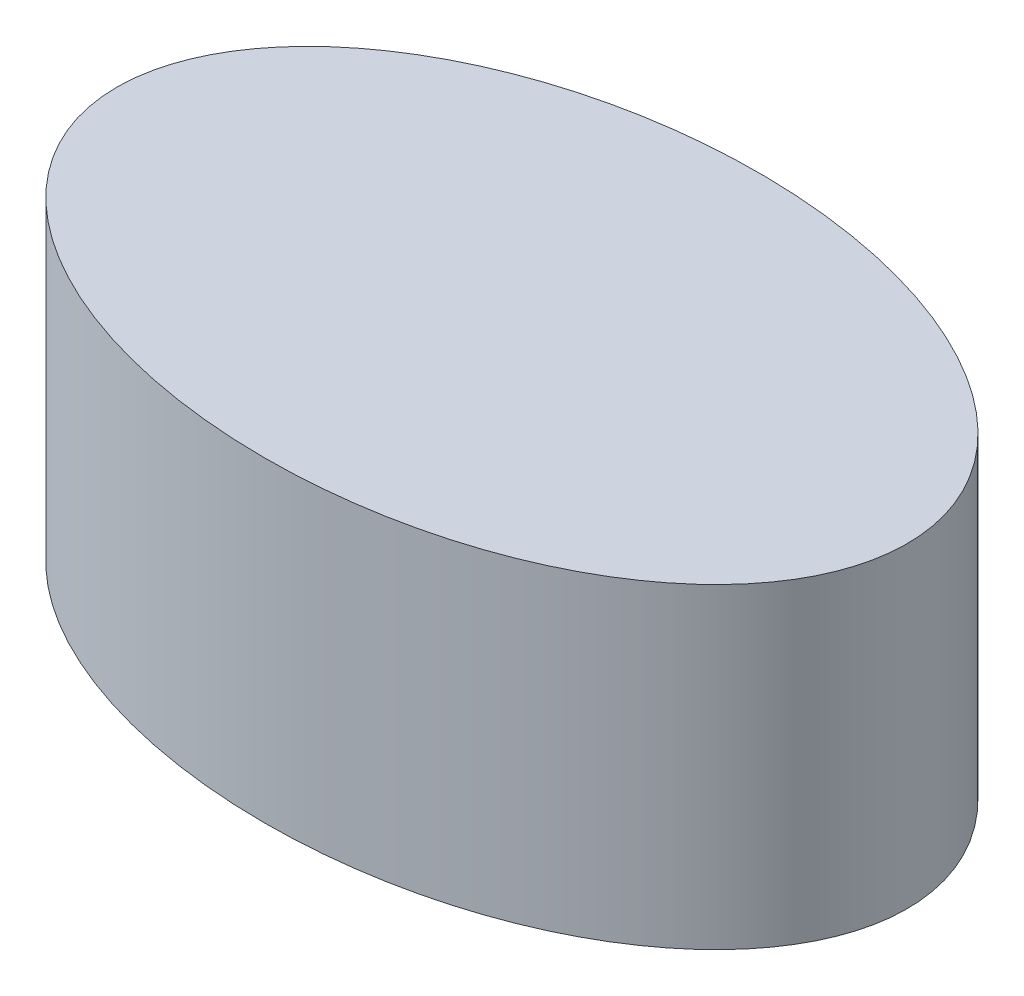
ISO-10303-21;
HEADER;
FILE_DESCRIPTION(('STEP AP214'),'2;1');
FILE_NAME('part.step','',(''),(''),'','','');
FILE_SCHEMA(('AUTOMOTIVE_DESIGN { 1 0 10303 214 1 1 1 1 }'));
ENDSEC;
DATA;
#1=APPLICATION_CONTEXT('core data for automotive mechanical design processes');
#2=APPLICATION_PROTOCOL_DEFINITION('international standard','automotive_design',2000,#1);
#3=PRODUCT_CONTEXT('',#1,'mechanical');
#4=PRODUCT('Part','Part','',(#3));
#5=PRODUCT_RELATED_PRODUCT_CATEGORY('part','',(#4));
#6=PRODUCT_DEFINITION_FORMATION('','',#4);
#7=PRODUCT_DEFINITION_CONTEXT('part definition',#1,'design');
#8=PRODUCT_DEFINITION('design','',#6,#7);
#9=PRODUCT_DEFINITION_SHAPE('','',#8);
#10=(LENGTH_UNIT() NAMED_UNIT(*) SI_UNIT(.MILLI.,.METRE.));
#11=(NAMED_UNIT(*) PLANE_ANGLE_UNIT() SI_UNIT($,.RADIAN.));
#12=(NAMED_UNIT(*) SI_UNIT($,.STERADIAN.) SOLID_ANGLE_UNIT());
#13=UNCERTAINTY_MEASURE_WITH_UNIT(LENGTH_MEASURE(1.E-05),#10,'distance_accuracy_value','');
#14=(GEOMETRIC_REPRESENTATION_CONTEXT(3) GLOBAL_UNCERTAINTY_ASSIGNED_CONTEXT((#13)) GLOBAL_UNIT_ASSIGNED_CONTEXT((#10,
#11,#12)) REPRESENTATION_CONTEXT('',''));
#15=CARTESIAN_POINT('',(0.,0.,0.));
#16=DIRECTION('',(0.,0.,1.));
#17=DIRECTION('',(1.,0.,0.));
#18=AXIS2_PLACEMENT_3D('',#15,#16,#17);
#19=CARTESIAN_POINT('',(0.,160.,0.));
#20=DIRECTION('',(0.,1.,0.));
#21=DIRECTION('',(-1.,0.,0.));
#22=AXIS2_PLACEMENT_3D('',#19,#20,#21);
#23=ELLIPSE('',#22,200.,125.);
#24=DIRECTION('',(0.,-1.,0.));
#25=VECTOR('',#24,1.);
#26=SURFACE_OF_LINEAR_EXTRUSION('',#23,#25);
#27=CARTESIAN_POINT('',(-200.,160.,0.));
#28=VERTEX_POINT('',#27);
#29=EDGE_CURVE('E10',#28,#28,#23,.T.);
#30=ORIENTED_EDGE('',*,*,#29,.F.);
#31=EDGE_LOOP('',(#30));
#32=FACE_BOUND('',#31,.T.);
#33=CARTESIAN_POINT('',(0.,0.,0.));
#34=DIRECTION('',(0.,1.,0.));
#35=DIRECTION('',(-1.,0.,0.));
#36=AXIS2_PLACEMENT_3D('',#33,#34,#35);
#37=ELLIPSE('',#36,200.,125.);
#38=CARTESIAN_POINT('',(-200.,0.,0.));
#39=VERTEX_POINT('',#38);
#40=EDGE_CURVE('E39',#39,#39,#37,.T.);
#41=ORIENTED_EDGE('',*,*,#40,.T.);
#42=EDGE_LOOP('',(#41));
#43=FACE_BOUND('',#42,.T.);
#44=ADVANCED_FACE('F35',(#32,#43),#26,.F.);
#45=CARTESIAN_POINT('',(0.,160.,0.));
#46=DIRECTION('',(0.,1.,0.));
#47=DIRECTION('',(0.,0.,1.));
#48=AXIS2_PLACEMENT_3D('',#45,#46,#47);
#49=PLANE('',#48);
#50=ORIENTED_EDGE('',*,*,#29,.T.);
#51=EDGE_LOOP('',(#50));
#52=FACE_BOUND('',#51,.T.);
#53=ADVANCED_FACE('F51',(#52),#49,.T.);
#54=CARTESIAN_POINT('',(0.,0.,0.));
#55=DIRECTION('',(0.,1.,0.));
#56=DIRECTION('',(0.,0.,1.));
#57=AXIS2_PLACEMENT_3D('',#54,#55,#56);
#58=PLANE('',#57);
#59=ORIENTED_EDGE('',*,*,#40,.F.);
#60=EDGE_LOOP('',(#59));
#61=FACE_BOUND('',#60,.T.);
#62=ADVANCED_FACE('F49',(#61),#58,.F.);
#63=CLOSED_SHELL('',(#44,#53,#62));
#64=MANIFOLD_SOLID_BREP('B2',#63);
#65=ADVANCED_BREP_SHAPE_REPRESENTATION('',(#18,#64),#14);
#66=SHAPE_DEFINITION_REPRESENTATION(#9,#65);
ENDSEC;
END-ISO-10303-21;
